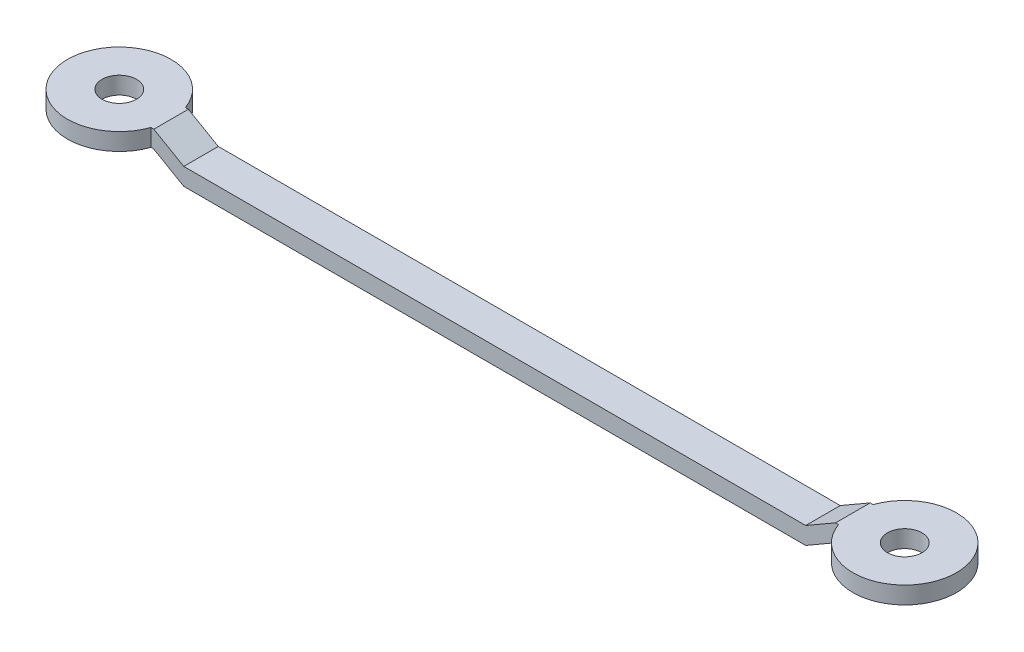
ISO-10303-21;
HEADER;
FILE_DESCRIPTION(('STEP AP214'),'2;1');
FILE_NAME('part.step','',(''),(''),'','','');
FILE_SCHEMA(('AUTOMOTIVE_DESIGN { 1 0 10303 214 1 1 1 1 }'));
ENDSEC;
DATA;
#1=APPLICATION_CONTEXT('core data for automotive mechanical design processes');
#2=APPLICATION_PROTOCOL_DEFINITION('international standard','automotive_design',2000,#1);
#3=PRODUCT_CONTEXT('',#1,'mechanical');
#4=PRODUCT('Part','Part','',(#3));
#5=PRODUCT_RELATED_PRODUCT_CATEGORY('part','',(#4));
#6=PRODUCT_DEFINITION_FORMATION('','',#4);
#7=PRODUCT_DEFINITION_CONTEXT('part definition',#1,'design');
#8=PRODUCT_DEFINITION('design','',#6,#7);
#9=PRODUCT_DEFINITION_SHAPE('','',#8);
#10=(LENGTH_UNIT() NAMED_UNIT(*) SI_UNIT(.MILLI.,.METRE.));
#11=(NAMED_UNIT(*) PLANE_ANGLE_UNIT() SI_UNIT($,.RADIAN.));
#12=(NAMED_UNIT(*) SI_UNIT($,.STERADIAN.) SOLID_ANGLE_UNIT());
#13=UNCERTAINTY_MEASURE_WITH_UNIT(LENGTH_MEASURE(1.E-05),#10,'distance_accuracy_value','');
#14=(GEOMETRIC_REPRESENTATION_CONTEXT(3) GLOBAL_UNCERTAINTY_ASSIGNED_CONTEXT((#13)) GLOBAL_UNIT_ASSIGNED_CONTEXT((#10,
#11,#12)) REPRESENTATION_CONTEXT('',''));
#15=CARTESIAN_POINT('',(0.,0.,0.));
#16=DIRECTION('',(0.,0.,1.));
#17=DIRECTION('',(1.,0.,0.));
#18=AXIS2_PLACEMENT_3D('',#15,#16,#17);
#19=CARTESIAN_POINT('',(-18.,0.,2.));
#20=DIRECTION('',(-0.499999999999996,-0.866025403784441,0.));
#21=DIRECTION('',(0.866025403784441,-0.499999999999996,0.));
#22=AXIS2_PLACEMENT_3D('',#19,#20,#21);
#23=PLANE('',#22);
#24=DIRECTION('',(-0.866025403784441,0.499999999999996,0.));
#25=VECTOR('',#24,1.);
#26=CARTESIAN_POINT('',(-18.,0.,0.));
#27=LINE('',#26,#25);
#28=CARTESIAN_POINT('',(-18.,0.,0.));
#29=VERTEX_POINT('',#28);
#30=CARTESIAN_POINT('',(-19.7320508075689,0.999999999999992,0.));
#31=VERTEX_POINT('',#30);
#32=EDGE_CURVE('E157',#29,#31,#27,.T.);
#33=ORIENTED_EDGE('',*,*,#32,.F.);
#34=DIRECTION('',(0.,0.,-1.));
#35=VECTOR('',#34,1.);
#36=CARTESIAN_POINT('',(-18.,0.,2.));
#37=LINE('',#36,#35);
#38=CARTESIAN_POINT('',(-18.,0.,2.));
#39=VERTEX_POINT('',#38);
#40=EDGE_CURVE('E50',#39,#29,#37,.T.);
#41=ORIENTED_EDGE('',*,*,#40,.F.);
#42=DIRECTION('',(-0.866025403784441,0.499999999999996,0.));
#43=VECTOR('',#42,1.);
#44=CARTESIAN_POINT('',(-18.,0.,2.));
#45=LINE('',#44,#43);
#46=CARTESIAN_POINT('',(-19.7320508075689,0.999999999999992,2.));
#47=VERTEX_POINT('',#46);
#48=EDGE_CURVE('E192',#39,#47,#45,.T.);
#49=ORIENTED_EDGE('',*,*,#48,.T.);
#50=DIRECTION('',(0.,0.,-1.));
#51=VECTOR('',#50,1.);
#52=CARTESIAN_POINT('',(-19.7320508075689,0.999999999999992,2.));
#53=LINE('',#52,#51);
#54=EDGE_CURVE('E215',#47,#31,#53,.T.);
#55=ORIENTED_EDGE('',*,*,#54,.T.);
#56=EDGE_LOOP('',(#33,#41,#49,#55));
#57=FACE_BOUND('',#56,.T.);
#58=ADVANCED_FACE('F41',(#57),#23,.T.);
#59=CARTESIAN_POINT('',(-18.,0.,2.));
#60=DIRECTION('',(0.,1.,0.));
#61=DIRECTION('',(0.,0.,1.));
#62=AXIS2_PLACEMENT_3D('',#59,#60,#61);
#63=PLANE('',#62);
#64=DIRECTION('',(1.,0.,0.));
#65=VECTOR('',#64,1.);
#66=CARTESIAN_POINT('',(-18.,0.,0.));
#67=LINE('',#66,#65);
#68=CARTESIAN_POINT('',(18.,0.,0.));
#69=VERTEX_POINT('',#68);
#70=EDGE_CURVE('E189',#29,#69,#67,.T.);
#71=ORIENTED_EDGE('',*,*,#70,.T.);
#72=DIRECTION('',(0.,0.,-1.));
#73=VECTOR('',#72,1.);
#74=CARTESIAN_POINT('',(18.,0.,2.));
#75=LINE('',#74,#73);
#76=CARTESIAN_POINT('',(18.,0.,2.));
#77=VERTEX_POINT('',#76);
#78=EDGE_CURVE('E195',#77,#69,#75,.T.);
#79=ORIENTED_EDGE('',*,*,#78,.F.);
#80=DIRECTION('',(1.,0.,0.));
#81=VECTOR('',#80,1.);
#82=CARTESIAN_POINT('',(-18.,0.,2.));
#83=LINE('',#82,#81);
#84=EDGE_CURVE('E217',#39,#77,#83,.T.);
#85=ORIENTED_EDGE('',*,*,#84,.F.);
#86=ORIENTED_EDGE('',*,*,#40,.T.);
#87=EDGE_LOOP('',(#71,#79,#85,#86));
#88=FACE_BOUND('',#87,.T.);
#89=ADVANCED_FACE('F285',(#88),#63,.F.);
#90=CARTESIAN_POINT('',(18.,0.,2.));
#91=DIRECTION('',(-0.499999999999995,0.866025403784441,0.));
#92=DIRECTION('',(-0.866025403784441,-0.499999999999995,0.));
#93=AXIS2_PLACEMENT_3D('',#90,#91,#92);
#94=PLANE('',#93);
#95=DIRECTION('',(0.866025403784441,0.499999999999995,0.));
#96=VECTOR('',#95,1.);
#97=CARTESIAN_POINT('',(18.,0.,0.));
#98=LINE('',#97,#96);
#99=CARTESIAN_POINT('',(19.7320508075689,0.99999999999999,0.));
#100=VERTEX_POINT('',#99);
#101=EDGE_CURVE('E185',#69,#100,#98,.T.);
#102=ORIENTED_EDGE('',*,*,#101,.T.);
#103=DIRECTION('',(0.,0.,-1.));
#104=VECTOR('',#103,1.);
#105=CARTESIAN_POINT('',(19.7320508075689,0.99999999999999,2.));
#106=LINE('',#105,#104);
#107=CARTESIAN_POINT('',(19.7320508075689,0.99999999999999,2.));
#108=VERTEX_POINT('',#107);
#109=EDGE_CURVE('E199',#108,#100,#106,.T.);
#110=ORIENTED_EDGE('',*,*,#109,.F.);
#111=DIRECTION('',(0.866025403784441,0.499999999999995,0.));
#112=VECTOR('',#111,1.);
#113=CARTESIAN_POINT('',(18.,0.,2.));
#114=LINE('',#113,#112);
#115=EDGE_CURVE('E275',#77,#108,#114,.T.);
#116=ORIENTED_EDGE('',*,*,#115,.F.);
#117=ORIENTED_EDGE('',*,*,#78,.T.);
#118=EDGE_LOOP('',(#102,#110,#116,#117));
#119=FACE_BOUND('',#118,.T.);
#120=ADVANCED_FACE('F288',(#119),#94,.F.);
#121=CARTESIAN_POINT('',(19.7320508075689,0.99999999999999,2.));
#122=DIRECTION('',(0.,1.,0.));
#123=DIRECTION('',(-1.,0.,0.));
#124=AXIS2_PLACEMENT_3D('',#121,#122,#123);
#125=PLANE('',#124);
#126=CARTESIAN_POINT('',(22.7320508075689,1.00000000000001,1.));
#127=DIRECTION('',(0.,1.,0.));
#128=DIRECTION('',(-1.,0.,0.));
#129=AXIS2_PLACEMENT_3D('',#126,#127,#128);
#130=CIRCLE('',#129,1.);
#131=CARTESIAN_POINT('',(21.7320508075689,1.00000000000001,1.));
#132=VERTEX_POINT('',#131);
#133=EDGE_CURVE('E231',#132,#132,#130,.T.);
#134=ORIENTED_EDGE('',*,*,#133,.T.);
#135=EDGE_LOOP('',(#134));
#136=FACE_BOUND('',#135,.T.);
#137=DIRECTION('',(1.,0.,0.));
#138=VECTOR('',#137,1.);
#139=CARTESIAN_POINT('',(19.7320508075689,0.99999999999999,0.));
#140=LINE('',#139,#138);
#141=CARTESIAN_POINT('',(19.9036236828227,0.999999999999992,0.));
#142=VERTEX_POINT('',#141);
#143=EDGE_CURVE('E181',#100,#142,#140,.T.);
#144=ORIENTED_EDGE('',*,*,#143,.T.);
#145=CARTESIAN_POINT('',(22.7320508075689,0.999999999999974,1.));
#146=DIRECTION('',(0.,1.,0.));
#147=DIRECTION('',(-1.,0.,0.));
#148=AXIS2_PLACEMENT_3D('',#145,#146,#147);
#149=CIRCLE('',#148,3.);
#150=CARTESIAN_POINT('',(19.9036236828227,0.999999999999992,2.));
#151=VERTEX_POINT('',#150);
#152=EDGE_CURVE('E237',#151,#142,#149,.T.);
#153=ORIENTED_EDGE('',*,*,#152,.F.);
#154=DIRECTION('',(1.,0.,0.));
#155=VECTOR('',#154,1.);
#156=CARTESIAN_POINT('',(19.7320508075689,0.99999999999999,2.));
#157=LINE('',#156,#155);
#158=EDGE_CURVE('E63',#108,#151,#157,.T.);
#159=ORIENTED_EDGE('',*,*,#158,.F.);
#160=ORIENTED_EDGE('',*,*,#109,.T.);
#161=EDGE_LOOP('',(#144,#153,#159,#160));
#162=FACE_BOUND('',#161,.T.);
#163=ADVANCED_FACE('F292',(#136,#162),#125,.F.);
#164=CARTESIAN_POINT('',(19.7320508075689,1.99999999999997,2.));
#165=DIRECTION('',(0.,1.,0.));
#166=DIRECTION('',(-1.,0.,0.));
#167=AXIS2_PLACEMENT_3D('',#164,#165,#166);
#168=PLANE('',#167);
#169=CARTESIAN_POINT('',(22.7320508075689,2.00000000000002,1.));
#170=DIRECTION('',(0.,1.,0.));
#171=DIRECTION('',(-1.,0.,0.));
#172=AXIS2_PLACEMENT_3D('',#169,#170,#171);
#173=CIRCLE('',#172,1.);
#174=CARTESIAN_POINT('',(21.7320508075689,2.,1.));
#175=VERTEX_POINT('',#174);
#176=EDGE_CURVE('E44',#175,#175,#173,.T.);
#177=ORIENTED_EDGE('',*,*,#176,.F.);
#178=EDGE_LOOP('',(#177));
#179=FACE_BOUND('',#178,.T.);
#180=DIRECTION('',(1.,0.,0.));
#181=VECTOR('',#180,1.);
#182=CARTESIAN_POINT('',(19.7320508075689,1.99999999999997,0.));
#183=LINE('',#182,#181);
#184=CARTESIAN_POINT('',(19.7320508075689,1.99999999999997,0.));
#185=VERTEX_POINT('',#184);
#186=CARTESIAN_POINT('',(19.9036236828227,1.99999999999997,0.));
#187=VERTEX_POINT('',#186);
#188=EDGE_CURVE('E178',#185,#187,#183,.T.);
#189=ORIENTED_EDGE('',*,*,#188,.F.);
#190=DIRECTION('',(0.,0.,-1.));
#191=VECTOR('',#190,1.);
#192=CARTESIAN_POINT('',(19.7320508075689,1.99999999999997,2.));
#193=LINE('',#192,#191);
#194=CARTESIAN_POINT('',(19.7320508075689,1.99999999999997,2.));
#195=VERTEX_POINT('',#194);
#196=EDGE_CURVE('E202',#195,#185,#193,.T.);
#197=ORIENTED_EDGE('',*,*,#196,.F.);
#198=DIRECTION('',(1.,0.,0.));
#199=VECTOR('',#198,1.);
#200=CARTESIAN_POINT('',(19.7320508075689,1.99999999999997,2.));
#201=LINE('',#200,#199);
#202=CARTESIAN_POINT('',(19.9036236828227,1.99999999999997,2.));
#203=VERTEX_POINT('',#202);
#204=EDGE_CURVE('E270',#195,#203,#201,.T.);
#205=ORIENTED_EDGE('',*,*,#204,.T.);
#206=CARTESIAN_POINT('',(22.7320508075689,1.99999999999997,1.));
#207=DIRECTION('',(0.,1.,0.));
#208=DIRECTION('',(-1.,0.,0.));
#209=AXIS2_PLACEMENT_3D('',#206,#207,#208);
#210=CIRCLE('',#209,3.);
#211=EDGE_CURVE('E236',#203,#187,#210,.T.);
#212=ORIENTED_EDGE('',*,*,#211,.T.);
#213=EDGE_LOOP('',(#189,#197,#205,#212));
#214=FACE_BOUND('',#213,.T.);
#215=ADVANCED_FACE('F298',(#179,#214),#168,.T.);
#216=CARTESIAN_POINT('',(18.,1.,2.));
#217=DIRECTION('',(-0.499999999999987,0.866025403784446,0.));
#218=DIRECTION('',(-0.866025403784446,-0.499999999999987,0.));
#219=AXIS2_PLACEMENT_3D('',#216,#217,#218);
#220=PLANE('',#219);
#221=DIRECTION('',(0.866025403784446,0.499999999999987,0.));
#222=VECTOR('',#221,1.);
#223=CARTESIAN_POINT('',(18.,1.,0.));
#224=LINE('',#223,#222);
#225=CARTESIAN_POINT('',(18.,1.,0.));
#226=VERTEX_POINT('',#225);
#227=EDGE_CURVE('E174',#226,#185,#224,.T.);
#228=ORIENTED_EDGE('',*,*,#227,.F.);
#229=DIRECTION('',(0.,0.,-1.));
#230=VECTOR('',#229,1.);
#231=CARTESIAN_POINT('',(18.,1.,2.));
#232=LINE('',#231,#230);
#233=CARTESIAN_POINT('',(18.,1.,2.));
#234=VERTEX_POINT('',#233);
#235=EDGE_CURVE('E205',#234,#226,#232,.T.);
#236=ORIENTED_EDGE('',*,*,#235,.F.);
#237=DIRECTION('',(0.866025403784446,0.499999999999987,0.));
#238=VECTOR('',#237,1.);
#239=CARTESIAN_POINT('',(18.,1.,2.));
#240=LINE('',#239,#238);
#241=EDGE_CURVE('E266',#234,#195,#240,.T.);
#242=ORIENTED_EDGE('',*,*,#241,.T.);
#243=ORIENTED_EDGE('',*,*,#196,.T.);
#244=EDGE_LOOP('',(#228,#236,#242,#243));
#245=FACE_BOUND('',#244,.T.);
#246=ADVANCED_FACE('F303',(#245),#220,.T.);
#247=CARTESIAN_POINT('',(-18.,1.,2.));
#248=DIRECTION('',(0.,1.,0.));
#249=DIRECTION('',(0.,0.,1.));
#250=AXIS2_PLACEMENT_3D('',#247,#248,#249);
#251=PLANE('',#250);
#252=DIRECTION('',(1.,0.,0.));
#253=VECTOR('',#252,1.);
#254=CARTESIAN_POINT('',(-18.,1.,0.));
#255=LINE('',#254,#253);
#256=CARTESIAN_POINT('',(-18.,1.,0.));
#257=VERTEX_POINT('',#256);
#258=EDGE_CURVE('E170',#257,#226,#255,.T.);
#259=ORIENTED_EDGE('',*,*,#258,.F.);
#260=DIRECTION('',(0.,0.,-1.));
#261=VECTOR('',#260,1.);
#262=CARTESIAN_POINT('',(-18.,1.,2.));
#263=LINE('',#262,#261);
#264=CARTESIAN_POINT('',(-18.,1.,2.));
#265=VERTEX_POINT('',#264);
#266=EDGE_CURVE('E208',#265,#257,#263,.T.);
#267=ORIENTED_EDGE('',*,*,#266,.F.);
#268=DIRECTION('',(1.,0.,0.));
#269=VECTOR('',#268,1.);
#270=CARTESIAN_POINT('',(-18.,1.,2.));
#271=LINE('',#270,#269);
#272=EDGE_CURVE('E262',#265,#234,#271,.T.);
#273=ORIENTED_EDGE('',*,*,#272,.T.);
#274=ORIENTED_EDGE('',*,*,#235,.T.);
#275=EDGE_LOOP('',(#259,#267,#273,#274));
#276=FACE_BOUND('',#275,.T.);
#277=ADVANCED_FACE('F306',(#276),#251,.T.);
#278=CARTESIAN_POINT('',(-18.,1.,2.));
#279=DIRECTION('',(-0.499999999999995,-0.866025403784442,0.));
#280=DIRECTION('',(0.866025403784442,-0.499999999999995,0.));
#281=AXIS2_PLACEMENT_3D('',#278,#279,#280);
#282=PLANE('',#281);
#283=DIRECTION('',(-0.866025403784442,0.499999999999995,0.));
#284=VECTOR('',#283,1.);
#285=CARTESIAN_POINT('',(-18.,1.,0.));
#286=LINE('',#285,#284);
#287=CARTESIAN_POINT('',(-19.7320508075689,1.99999999999999,0.));
#288=VERTEX_POINT('',#287);
#289=EDGE_CURVE('E163',#257,#288,#286,.T.);
#290=ORIENTED_EDGE('',*,*,#289,.T.);
#291=DIRECTION('',(0.,0.,-1.));
#292=VECTOR('',#291,1.);
#293=CARTESIAN_POINT('',(-19.7320508075689,1.99999999999999,2.));
#294=LINE('',#293,#292);
#295=CARTESIAN_POINT('',(-19.7320508075689,1.99999999999999,2.));
#296=VERTEX_POINT('',#295);
#297=EDGE_CURVE('E211',#296,#288,#294,.T.);
#298=ORIENTED_EDGE('',*,*,#297,.F.);
#299=DIRECTION('',(-0.866025403784442,0.499999999999995,0.));
#300=VECTOR('',#299,1.);
#301=CARTESIAN_POINT('',(-18.,1.,2.));
#302=LINE('',#301,#300);
#303=EDGE_CURVE('E259',#265,#296,#302,.T.);
#304=ORIENTED_EDGE('',*,*,#303,.F.);
#305=ORIENTED_EDGE('',*,*,#266,.T.);
#306=EDGE_LOOP('',(#290,#298,#304,#305));
#307=FACE_BOUND('',#306,.T.);
#308=ADVANCED_FACE('F311',(#307),#282,.F.);
#309=CARTESIAN_POINT('',(-19.7320508075689,1.99999999999999,2.));
#310=DIRECTION('',(0.,-1.,0.));
#311=DIRECTION('',(1.,0.,0.));
#312=AXIS2_PLACEMENT_3D('',#309,#310,#311);
#313=PLANE('',#312);
#314=CARTESIAN_POINT('',(-22.7320508075689,1.99999999999999,1.));
#315=DIRECTION('',(0.,-1.,0.));
#316=DIRECTION('',(1.,0.,0.));
#317=AXIS2_PLACEMENT_3D('',#314,#315,#316);
#318=CIRCLE('',#317,1.);
#319=CARTESIAN_POINT('',(-21.7320508075689,1.99999999999999,1.));
#320=VERTEX_POINT('',#319);
#321=EDGE_CURVE('E221',#320,#320,#318,.T.);
#322=ORIENTED_EDGE('',*,*,#321,.T.);
#323=EDGE_LOOP('',(#322));
#324=FACE_BOUND('',#323,.T.);
#325=CARTESIAN_POINT('',(-22.7320508075689,1.99999999999999,1.));
#326=DIRECTION('',(0.,1.,0.));
#327=DIRECTION('',(-1.,0.,0.));
#328=AXIS2_PLACEMENT_3D('',#325,#326,#327);
#329=CIRCLE('',#328,3.);
#330=CARTESIAN_POINT('',(-19.9036236828227,1.99999999999999,0.));
#331=VERTEX_POINT('',#330);
#332=CARTESIAN_POINT('',(-19.9036236828227,1.99999999999999,2.));
#333=VERTEX_POINT('',#332);
#334=EDGE_CURVE('E136',#331,#333,#329,.T.);
#335=ORIENTED_EDGE('',*,*,#334,.T.);
#336=DIRECTION('',(-1.,0.,0.));
#337=VECTOR('',#336,1.);
#338=CARTESIAN_POINT('',(-19.7320508075689,1.99999999999999,2.));
#339=LINE('',#338,#337);
#340=EDGE_CURVE('E255',#296,#333,#339,.T.);
#341=ORIENTED_EDGE('',*,*,#340,.F.);
#342=ORIENTED_EDGE('',*,*,#297,.T.);
#343=DIRECTION('',(-1.,0.,0.));
#344=VECTOR('',#343,1.);
#345=CARTESIAN_POINT('',(-19.7320508075689,1.99999999999999,0.));
#346=LINE('',#345,#344);
#347=EDGE_CURVE('E159',#288,#331,#346,.T.);
#348=ORIENTED_EDGE('',*,*,#347,.T.);
#349=EDGE_LOOP('',(#335,#341,#342,#348));
#350=FACE_BOUND('',#349,.T.);
#351=ADVANCED_FACE('F314',(#324,#350),#313,.F.);
#352=CARTESIAN_POINT('',(-19.7320508075689,0.999999999999992,2.));
#353=DIRECTION('',(0.,-1.,0.));
#354=DIRECTION('',(1.,0.,0.));
#355=AXIS2_PLACEMENT_3D('',#352,#353,#354);
#356=PLANE('',#355);
#357=CARTESIAN_POINT('',(-22.7320508075689,0.999999999999972,1.));
#358=DIRECTION('',(0.,-1.,0.));
#359=DIRECTION('',(1.,0.,0.));
#360=AXIS2_PLACEMENT_3D('',#357,#358,#359);
#361=CIRCLE('',#360,1.);
#362=CARTESIAN_POINT('',(-21.7320508075689,0.999999999999978,1.));
#363=VERTEX_POINT('',#362);
#364=EDGE_CURVE('E218',#363,#363,#361,.T.);
#365=ORIENTED_EDGE('',*,*,#364,.F.);
#366=EDGE_LOOP('',(#365));
#367=FACE_BOUND('',#366,.T.);
#368=DIRECTION('',(-1.,0.,0.));
#369=VECTOR('',#368,1.);
#370=CARTESIAN_POINT('',(-19.7320508075689,0.999999999999992,2.));
#371=LINE('',#370,#369);
#372=CARTESIAN_POINT('',(-19.9036236828227,0.999999999999989,2.));
#373=VERTEX_POINT('',#372);
#374=EDGE_CURVE('E151',#47,#373,#371,.T.);
#375=ORIENTED_EDGE('',*,*,#374,.T.);
#376=CARTESIAN_POINT('',(-22.7320508075689,0.99999999999999,1.));
#377=DIRECTION('',(0.,1.,0.));
#378=DIRECTION('',(-1.,0.,0.));
#379=AXIS2_PLACEMENT_3D('',#376,#377,#378);
#380=CIRCLE('',#379,3.);
#381=CARTESIAN_POINT('',(-19.9036236828227,0.999999999999989,0.));
#382=VERTEX_POINT('',#381);
#383=EDGE_CURVE('E133',#382,#373,#380,.T.);
#384=ORIENTED_EDGE('',*,*,#383,.F.);
#385=DIRECTION('',(-1.,0.,0.));
#386=VECTOR('',#385,1.);
#387=CARTESIAN_POINT('',(-19.7320508075689,0.999999999999992,0.));
#388=LINE('',#387,#386);
#389=EDGE_CURVE('E148',#31,#382,#388,.T.);
#390=ORIENTED_EDGE('',*,*,#389,.F.);
#391=ORIENTED_EDGE('',*,*,#54,.F.);
#392=EDGE_LOOP('',(#375,#384,#390,#391));
#393=FACE_BOUND('',#392,.T.);
#394=ADVANCED_FACE('F147',(#367,#393),#356,.T.);
#395=CARTESIAN_POINT('',(0.,0.,2.));
#396=DIRECTION('',(0.,0.,-1.));
#397=DIRECTION('',(-1.,0.,0.));
#398=AXIS2_PLACEMENT_3D('',#395,#396,#397);
#399=PLANE('',#398);
#400=ORIENTED_EDGE('',*,*,#158,.T.);
#401=DIRECTION('',(0.,1.,0.));
#402=VECTOR('',#401,1.);
#403=CARTESIAN_POINT('',(19.9036236828227,0.999999999999975,2.));
#404=LINE('',#403,#402);
#405=EDGE_CURVE('E58',#151,#203,#404,.T.);
#406=ORIENTED_EDGE('',*,*,#405,.T.);
#407=ORIENTED_EDGE('',*,*,#204,.F.);
#408=ORIENTED_EDGE('',*,*,#241,.F.);
#409=ORIENTED_EDGE('',*,*,#272,.F.);
#410=ORIENTED_EDGE('',*,*,#303,.T.);
#411=ORIENTED_EDGE('',*,*,#340,.T.);
#412=DIRECTION('',(0.,1.,0.));
#413=VECTOR('',#412,1.);
#414=CARTESIAN_POINT('',(-19.9036236828227,0.999999999999989,2.));
#415=LINE('',#414,#413);
#416=EDGE_CURVE('E142',#373,#333,#415,.T.);
#417=ORIENTED_EDGE('',*,*,#416,.F.);
#418=ORIENTED_EDGE('',*,*,#374,.F.);
#419=ORIENTED_EDGE('',*,*,#48,.F.);
#420=ORIENTED_EDGE('',*,*,#84,.T.);
#421=ORIENTED_EDGE('',*,*,#115,.T.);
#422=EDGE_LOOP('',(#400,#406,#407,#408,#409,#410,#411,#417,#418,#419,#420,#421));
#423=FACE_BOUND('',#422,.T.);
#424=ADVANCED_FACE('F281',(#423),#399,.F.);
#425=CARTESIAN_POINT('',(0.,0.,0.));
#426=DIRECTION('',(0.,0.,-1.));
#427=DIRECTION('',(-1.,0.,0.));
#428=AXIS2_PLACEMENT_3D('',#425,#426,#427);
#429=PLANE('',#428);
#430=DIRECTION('',(0.,1.,0.));
#431=VECTOR('',#430,1.);
#432=CARTESIAN_POINT('',(19.9036236828227,0.999999999999975,0.));
#433=LINE('',#432,#431);
#434=EDGE_CURVE('E11',#142,#187,#433,.T.);
#435=ORIENTED_EDGE('',*,*,#434,.F.);
#436=ORIENTED_EDGE('',*,*,#143,.F.);
#437=ORIENTED_EDGE('',*,*,#101,.F.);
#438=ORIENTED_EDGE('',*,*,#70,.F.);
#439=ORIENTED_EDGE('',*,*,#32,.T.);
#440=ORIENTED_EDGE('',*,*,#389,.T.);
#441=DIRECTION('',(0.,1.,0.));
#442=VECTOR('',#441,1.);
#443=CARTESIAN_POINT('',(-19.9036236828227,0.999999999999989,0.));
#444=LINE('',#443,#442);
#445=EDGE_CURVE('E130',#382,#331,#444,.T.);
#446=ORIENTED_EDGE('',*,*,#445,.T.);
#447=ORIENTED_EDGE('',*,*,#347,.F.);
#448=ORIENTED_EDGE('',*,*,#289,.F.);
#449=ORIENTED_EDGE('',*,*,#258,.T.);
#450=ORIENTED_EDGE('',*,*,#227,.T.);
#451=ORIENTED_EDGE('',*,*,#188,.T.);
#452=EDGE_LOOP('',(#435,#436,#437,#438,#439,#440,#446,#447,#448,#449,#450,#451));
#453=FACE_BOUND('',#452,.T.);
#454=ADVANCED_FACE('F154',(#453),#429,.T.);
#455=CARTESIAN_POINT('',(-22.7320508075689,0.99999999999999,1.));
#456=DIRECTION('',(0.,1.,0.));
#457=DIRECTION('',(-1.,0.,0.));
#458=AXIS2_PLACEMENT_3D('',#455,#456,#457);
#459=CYLINDRICAL_SURFACE('',#458,3.);
#460=ORIENTED_EDGE('',*,*,#334,.F.);
#461=ORIENTED_EDGE('',*,*,#445,.F.);
#462=ORIENTED_EDGE('',*,*,#383,.T.);
#463=ORIENTED_EDGE('',*,*,#416,.T.);
#464=EDGE_LOOP('',(#460,#461,#462,#463));
#465=FACE_BOUND('',#464,.T.);
#466=ADVANCED_FACE('F132',(#465),#459,.T.);
#467=CARTESIAN_POINT('',(22.7320508075689,0.999999999999974,1.));
#468=DIRECTION('',(0.,1.,0.));
#469=DIRECTION('',(-1.,0.,0.));
#470=AXIS2_PLACEMENT_3D('',#467,#468,#469);
#471=CYLINDRICAL_SURFACE('',#470,3.);
#472=ORIENTED_EDGE('',*,*,#405,.F.);
#473=ORIENTED_EDGE('',*,*,#152,.T.);
#474=ORIENTED_EDGE('',*,*,#434,.T.);
#475=ORIENTED_EDGE('',*,*,#211,.F.);
#476=EDGE_LOOP('',(#472,#473,#474,#475));
#477=FACE_BOUND('',#476,.T.);
#478=ADVANCED_FACE('F294',(#477),#471,.T.);
#479=CARTESIAN_POINT('',(-22.7320508075689,0.,1.));
#480=DIRECTION('',(0.,1.,0.));
#481=DIRECTION('',(-1.,0.,0.));
#482=AXIS2_PLACEMENT_3D('',#479,#480,#481);
#483=CYLINDRICAL_SURFACE('',#482,1.);
#484=ORIENTED_EDGE('',*,*,#364,.T.);
#485=EDGE_LOOP('',(#484));
#486=FACE_BOUND('',#485,.T.);
#487=ORIENTED_EDGE('',*,*,#321,.F.);
#488=EDGE_LOOP('',(#487));
#489=FACE_BOUND('',#488,.T.);
#490=ADVANCED_FACE('F354',(#486,#489),#483,.F.);
#491=CARTESIAN_POINT('',(22.7320508075689,0.,1.));
#492=DIRECTION('',(0.,1.,0.));
#493=DIRECTION('',(-1.,0.,0.));
#494=AXIS2_PLACEMENT_3D('',#491,#492,#493);
#495=CYLINDRICAL_SURFACE('',#494,1.);
#496=ORIENTED_EDGE('',*,*,#176,.T.);
#497=EDGE_LOOP('',(#496));
#498=FACE_BOUND('',#497,.T.);
#499=ORIENTED_EDGE('',*,*,#133,.F.);
#500=EDGE_LOOP('',(#499));
#501=FACE_BOUND('',#500,.T.);
#502=ADVANCED_FACE('F355',(#498,#501),#495,.F.);
#503=CLOSED_SHELL('',(#58,#89,#120,#163,#215,#246,#277,#308,#351,#394,#424,#454,#466,#478,#490,#502));
#504=MANIFOLD_SOLID_BREP('B2',#503);
#505=ADVANCED_BREP_SHAPE_REPRESENTATION('',(#18,#504),#14);
#506=SHAPE_DEFINITION_REPRESENTATION(#9,#505);
ENDSEC;
END-ISO-10303-21;
